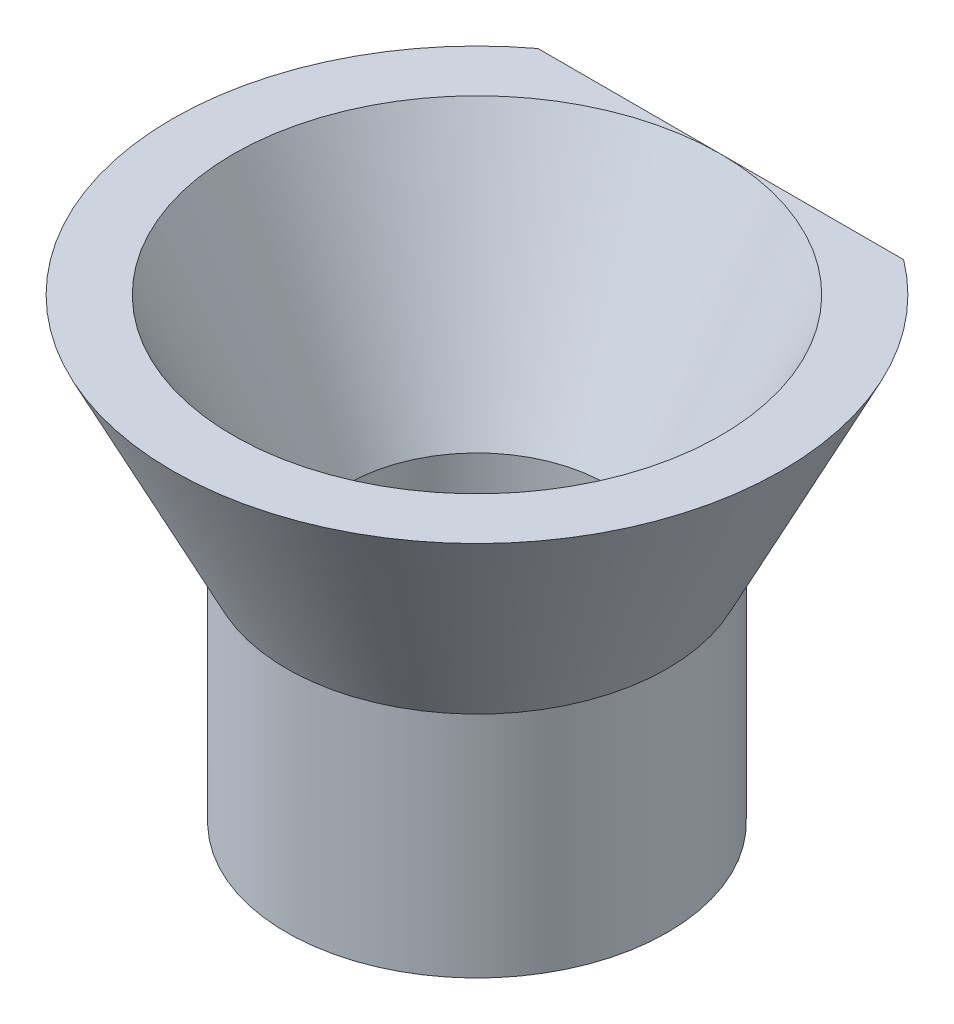
ISO-10303-21;
HEADER;
FILE_DESCRIPTION(('STEP AP214'),'2;1');
FILE_NAME('part.step','',(''),(''),'','','');
FILE_SCHEMA(('AUTOMOTIVE_DESIGN { 1 0 10303 214 1 1 1 1 }'));
ENDSEC;
DATA;
#1=APPLICATION_CONTEXT('core data for automotive mechanical design processes');
#2=APPLICATION_PROTOCOL_DEFINITION('international standard','automotive_design',2000,#1);
#3=PRODUCT_CONTEXT('',#1,'mechanical');
#4=PRODUCT('Part','Part','',(#3));
#5=PRODUCT_RELATED_PRODUCT_CATEGORY('part','',(#4));
#6=PRODUCT_DEFINITION_FORMATION('','',#4);
#7=PRODUCT_DEFINITION_CONTEXT('part definition',#1,'design');
#8=PRODUCT_DEFINITION('design','',#6,#7);
#9=PRODUCT_DEFINITION_SHAPE('','',#8);
#10=(LENGTH_UNIT() NAMED_UNIT(*) SI_UNIT(.MILLI.,.METRE.));
#11=(NAMED_UNIT(*) PLANE_ANGLE_UNIT() SI_UNIT($,.RADIAN.));
#12=(NAMED_UNIT(*) SI_UNIT($,.STERADIAN.) SOLID_ANGLE_UNIT());
#13=UNCERTAINTY_MEASURE_WITH_UNIT(LENGTH_MEASURE(1.E-05),#10,'distance_accuracy_value','');
#14=(GEOMETRIC_REPRESENTATION_CONTEXT(3) GLOBAL_UNCERTAINTY_ASSIGNED_CONTEXT((#13)) GLOBAL_UNIT_ASSIGNED_CONTEXT((#10,
#11,#12)) REPRESENTATION_CONTEXT('',''));
#15=CARTESIAN_POINT('',(0.,0.,0.));
#16=DIRECTION('',(0.,0.,1.));
#17=DIRECTION('',(1.,0.,0.));
#18=AXIS2_PLACEMENT_3D('',#15,#16,#17);
#19=CARTESIAN_POINT('',(0.,7.5,0.));
#20=DIRECTION('',(0.,1.,0.));
#21=DIRECTION('',(-1.,0.,0.));
#22=AXIS2_PLACEMENT_3D('',#19,#20,#21);
#23=CONICAL_SURFACE('',#22,10.,0.463647609000806);
#24=CARTESIAN_POINT('',(-12.483464519302,17.1537947928876,-8.));
#25=CARTESIAN_POINT('',(-12.2176903117161,16.7063471064967,-8.));
#26=CARTESIAN_POINT('',(-11.9501588751728,16.2599314212452,-8.));
#27=CARTESIAN_POINT('',(-11.4106666124813,15.3696780544552,-8.));
#28=CARTESIAN_POINT('',(-11.1387050071489,14.925840845459,-8.));
#29=CARTESIAN_POINT('',(-10.5874263949526,14.0380279909692,-8.));
#30=CARTESIAN_POINT('',(-10.3080689840772,13.594077367496,-8.));
#31=CARTESIAN_POINT('',(-9.74281308784089,12.7104203614526,-8.));
#32=CARTESIAN_POINT('',(-9.45691528753597,12.2707135411741,-8.));
#33=CARTESIAN_POINT('',(-8.84883235785064,11.354383788697,-8.));
#34=CARTESIAN_POINT('',(-8.52581443985341,10.8783097952812,-8.));
#35=CARTESIAN_POINT('',(-8.03152644212765,10.1708857963982,-8.));
#36=CARTESIAN_POINT('',(-7.86510364770432,9.93614734917569,-8.));
#37=CARTESIAN_POINT('',(-7.52849514478863,9.46938761143708,-8.));
#38=CARTESIAN_POINT('',(-7.35830954051645,9.2373662459364,-8.));
#39=CARTESIAN_POINT('',(-7.01414565228661,8.77739717629892,-8.));
#40=CARTESIAN_POINT('',(-6.8401825165595,8.5494381608394,-8.));
#41=CARTESIAN_POINT('',(-6.48713759743495,8.0975286635059,-8.));
#42=CARTESIAN_POINT('',(-6.30805613041065,7.87357793525815,-8.));
#43=CARTESIAN_POINT('',(-5.94391532388486,7.43080418466517,-8.));
#44=CARTESIAN_POINT('',(-5.75885968096171,7.21197813072789,-8.));
#45=CARTESIAN_POINT('',(-5.38148591572462,6.78070323424621,-8.));
#46=CARTESIAN_POINT('',(-5.18916913263823,6.56825322856726,-8.));
#47=CARTESIAN_POINT('',(-4.89787556173575,6.25982658488011,-8.));
#48=CARTESIAN_POINT('',(-4.80228291768864,6.16065045177227,-8.));
#49=CARTESIAN_POINT('',(-4.60885073612191,5.9645128013991,-8.));
#50=CARTESIAN_POINT('',(-4.51101114716198,5.86755133493669,-8.));
#51=CARTESIAN_POINT('',(-4.21367336017731,5.58035643879239,-8.));
#52=CARTESIAN_POINT('',(-4.0104535757572,5.39391680882617,-8.));
#53=CARTESIAN_POINT('',(-3.59418032767355,5.03660414230026,-8.));
#54=CARTESIAN_POINT('',(-3.3812447140748,4.86559477381106,-8.));
#55=CARTESIAN_POINT('',(-2.94154972325818,4.54241182107781,-8.));
#56=CARTESIAN_POINT('',(-2.7148057375995,4.39021781769847,-8.));
#57=CARTESIAN_POINT('',(-2.36571692774588,4.18348931214176,-8.));
#58=CARTESIAN_POINT('',(-2.24934355969825,4.11884271987032,-8.));
#59=CARTESIAN_POINT('',(-2.01272299557833,3.99702727146163,-8.));
#60=CARTESIAN_POINT('',(-1.89247607342263,3.93985788801741,-8.));
#61=CARTESIAN_POINT('',(-1.64826888681976,3.83433164269941,-8.));
#62=CARTESIAN_POINT('',(-1.52431186442723,3.78596733407817,-8.));
#63=CARTESIAN_POINT('',(-1.27291252397117,3.69938101083731,-8.));
#64=CARTESIAN_POINT('',(-1.1454712285237,3.66115605488138,-8.));
#65=CARTESIAN_POINT('',(-0.885883764474307,3.59571299911659,-8.));
#66=CARTESIAN_POINT('',(-0.753696899728019,3.56865446917873,-8.));
#67=CARTESIAN_POINT('',(-0.487310782236509,3.52745744891243,-8.));
#68=CARTESIAN_POINT('',(-0.353111680500533,3.51331799394967,-8.));
#69=CARTESIAN_POINT('',(-0.0839698811136931,3.49861979346302,-8.));
#70=CARTESIAN_POINT('',(0.0509727801258223,3.49806038874664,-8.));
#71=CARTESIAN_POINT('',(0.320218028186442,3.51054986637249,-8.));
#72=CARTESIAN_POINT('',(0.45452064020834,3.52359820841209,-8.));
#73=CARTESIAN_POINT('',(0.702065443281383,3.55987622339056,-8.));
#74=CARTESIAN_POINT('',(0.815566443141345,3.58137795941833,-8.));
#75=CARTESIAN_POINT('',(1.04054660506672,3.63322466963792,-8.));
#76=CARTESIAN_POINT('',(1.15202503793673,3.66357276845548,-8.));
#77=CARTESIAN_POINT('',(1.48258813463464,3.76662478948319,-8.));
#78=CARTESIAN_POINT('',(1.69797589838726,3.85136427944728,-8.));
#79=CARTESIAN_POINT('',(2.09779945819872,4.03678535252537,-8.));
#80=CARTESIAN_POINT('',(2.28326894085057,4.1353170818644,-8.));
#81=CARTESIAN_POINT('',(2.64497555504296,4.34826658550399,-8.));
#82=CARTESIAN_POINT('',(2.8212046881153,4.46269781968723,-8.));
#83=CARTESIAN_POINT('',(3.16584266642003,4.70422977822699,-8.));
#84=CARTESIAN_POINT('',(3.33421242981379,4.83138559599771,-8.));
#85=CARTESIAN_POINT('',(3.66326334100313,5.09508958557527,-8.));
#86=CARTESIAN_POINT('',(3.82394744691278,5.23163409365674,-8.));
#87=CARTESIAN_POINT('',(4.11754500865638,5.49325586582671,-8.));
#88=CARTESIAN_POINT('',(4.25128862139127,5.61740832722549,-8.));
#89=CARTESIAN_POINT('',(4.51441446369866,5.87026359513582,-8.));
#90=CARTESIAN_POINT('',(4.64379621931544,5.99896689304435,-8.));
#91=CARTESIAN_POINT('',(5.02632542321177,6.39082158669076,-8.));
#92=CARTESIAN_POINT('',(5.27371879372437,6.65959206458879,-8.));
#93=CARTESIAN_POINT('',(5.75704019091339,7.2082683944095,-8.));
#94=CARTESIAN_POINT('',(5.99293927481209,7.48819942386408,-8.));
#95=CARTESIAN_POINT('',(6.45508154291409,8.05576300022805,-8.));
#96=CARTESIAN_POINT('',(6.68132734629828,8.34339342318177,-8.));
#97=CARTESIAN_POINT('',(7.12831810484655,8.92746203108451,-8.));
#98=CARTESIAN_POINT('',(7.34898503910514,9.22395964826599,-8.));
#99=CARTESIAN_POINT('',(7.78388862375593,9.82164695571978,-8.));
#100=CARTESIAN_POINT('',(7.99812489025303,10.1228369244901,-8.));
#101=CARTESIAN_POINT('',(8.42093451624405,10.7284667299519,-8.));
#102=CARTESIAN_POINT('',(8.62951609145557,11.0329008451034,-8.));
#103=CARTESIAN_POINT('',(9.042210255015,11.6447631927312,-8.));
#104=CARTESIAN_POINT('',(9.24632298859126,11.9521913274373,-8.));
#105=CARTESIAN_POINT('',(9.65419435106521,12.5747528847138,-8.));
#106=CARTESIAN_POINT('',(9.85788834888876,12.8899285919333,-8.));
#107=CARTESIAN_POINT('',(10.2619351315843,13.5224161079553,-8.));
#108=CARTESIAN_POINT('',(10.4622878788336,13.8397279407545,-8.));
#109=CARTESIAN_POINT('',(11.059070191969,14.794380045024,-8.));
#110=CARTESIAN_POINT('',(11.4512039792901,15.434406405049,-8.));
#111=CARTESIAN_POINT('',(12.2268695889755,16.7198119160323,-8.));
#112=CARTESIAN_POINT('',(12.6103995849563,17.3651921644043,-8.));
#113=CARTESIAN_POINT('',(13.3706823528799,18.6599376968411,-8.));
#114=CARTESIAN_POINT('',(13.7474350401016,19.3093030305863,-8.));
#115=CARTESIAN_POINT('',(14.4961188219649,20.6121367190857,-8.));
#116=CARTESIAN_POINT('',(14.868041571539,21.2656098616909,-8.));
#117=CARTESIAN_POINT('',(15.6074999825743,22.5750360683232,-8.));
#118=CARTESIAN_POINT('',(15.9750356188315,23.230989146569,-8.));
#119=CARTESIAN_POINT('',(16.7064496749248,24.5448167508334,-8.));
#120=CARTESIAN_POINT('',(17.0703285682515,25.2026910134725,-8.));
#121=CARTESIAN_POINT('',(17.7950766936827,26.5200952779197,-8.));
#122=CARTESIAN_POINT('',(18.1559459213497,27.1796252821673,-8.));
#123=CARTESIAN_POINT('',(19.1779117828042,29.0558909829487,-8.));
#124=CARTESIAN_POINT('',(19.8359898841221,30.274270749616,-8.));
#125=CARTESIAN_POINT('',(21.1457856486666,32.7144995736717,-8.));
#126=CARTESIAN_POINT('',(21.7975030622119,33.9363487648373,-8.));
#127=CARTESIAN_POINT('',(23.0943557433501,36.3795258135076,-8.));
#128=CARTESIAN_POINT('',(23.739503590879,37.6008469968123,-8.));
#129=CARTESIAN_POINT('',(24.7043183109229,39.4343179513706,-8.));
#130=CARTESIAN_POINT('',(25.0254307445334,40.045707881065,-8.));
#131=CARTESIAN_POINT('',(25.6667891904272,41.2689413810986,-8.));
#132=CARTESIAN_POINT('',(25.98703520345,41.8807849510501,-8.));
#133=CARTESIAN_POINT('',(26.3068968591933,42.4928294365815,-8.));
#134=B_SPLINE_CURVE_WITH_KNOTS('',3,(#24,#25,#26,#27,#28,#29,#30,#31,#32,#33,#34,#35,#36,#37,
#38,#39,#40,#41,#42,#43,#44,#45,#46,#47,#48,#49,#50,#51,#52,#53,#54,#55,#56,#57,#58,#59,#60,#61,
#62,#63,#64,#65,#66,#67,#68,#69,#70,#71,#72,#73,#74,#75,#76,#77,#78,#79,#80,#81,#82,#83,#84,#85,
#86,#87,#88,#89,#90,#91,#92,#93,#94,#95,#96,#97,#98,#99,#100,#101,#102,#103,#104,#105,#106,#107,
#108,#109,#110,#111,#112,#113,#114,#115,#116,#117,#118,#119,#120,#121,#122,#123,#124,#125,#126,
#127,#128,#129,#130,#131,#132,#133),.UNSPECIFIED.,.F.,.F.,(4,2,2,2,2,2,2,2,2,2,2,2,2,2,2,2,2,2,
2,2,2,2,2,2,2,2,2,2,2,2,2,2,2,2,2,2,2,2,2,2,2,2,2,2,2,2,2,2,2,2,2,2,2,2,4),(0.,1.5612949852985,
3.12286760343757,4.69641124818769,6.26979082411401,7.99554726640557,8.85876089760058,
9.72195064986757,10.5821558211341,11.4423079360965,12.30193765725,13.1614095974944,
13.5746138450108,13.9878275616449,14.8146827483492,15.6333175375342,16.451055966143,
16.8502131202635,17.2493421098671,17.648131958487,18.0468059948763,18.4509948103106,
18.8551534435314,19.2592924583513,19.6634154272329,20.0095983748899,20.3559037463722,
21.047987423375,21.6771489669809,22.3068464160031,22.9393990392057,23.5717062087011,
24.1190426290518,24.6664383320794,25.7617888200302,26.8597682328395,27.9574478164105,
29.0661466221373,30.1749114833622,31.2819681987751,32.3889888835114,33.5147715751334,
34.6405669346172,36.8922668507071,39.1444403115686,41.3966419066966,43.6523217945701,
45.9080146351075,48.163411534726,50.4188117591244,54.573014806228,58.727380271121,
62.8711096162574,64.9428710526221,67.0146307203731),.UNSPECIFIED.);
#135=CARTESIAN_POINT('',(6.,7.5,-8.));
#136=VERTEX_POINT('',#135);
#137=CARTESIAN_POINT('',(-6.,7.5,-8.));
#138=VERTEX_POINT('',#137);
#139=EDGE_CURVE('E51',#136,#138,#134,.F.);
#140=ORIENTED_EDGE('',*,*,#139,.F.);
#141=CARTESIAN_POINT('',(0.,7.5,0.));
#142=DIRECTION('',(0.,1.,0.));
#143=DIRECTION('',(-1.,0.,0.));
#144=AXIS2_PLACEMENT_3D('',#141,#142,#143);
#145=CIRCLE('',#144,10.);
#146=EDGE_CURVE('E61',#138,#136,#145,.T.);
#147=ORIENTED_EDGE('',*,*,#146,.F.);
#148=EDGE_LOOP('',(#140,#147));
#149=FACE_BOUND('',#148,.T.);
#150=CARTESIAN_POINT('',(0.,0.,0.));
#151=DIRECTION('',(0.,-1.,0.));
#152=DIRECTION('',(1.,0.,0.));
#153=AXIS2_PLACEMENT_3D('',#150,#151,#152);
#154=CIRCLE('',#153,6.25);
#155=CARTESIAN_POINT('',(6.25,0.,0.));
#156=VERTEX_POINT('',#155);
#157=EDGE_CURVE('E70',#156,#156,#154,.T.);
#158=ORIENTED_EDGE('',*,*,#157,.F.);
#159=EDGE_LOOP('',(#158));
#160=FACE_BOUND('',#159,.T.);
#161=ADVANCED_FACE('F33',(#149,#160),#23,.T.);
#162=CARTESIAN_POINT('',(0.,0.,0.));
#163=DIRECTION('',(0.,1.,0.));
#164=DIRECTION('',(-1.,0.,0.));
#165=AXIS2_PLACEMENT_3D('',#162,#163,#164);
#166=CONICAL_SURFACE('',#165,4.25,0.463647609000806);
#167=CARTESIAN_POINT('',(0.,7.5,0.));
#168=DIRECTION('',(0.,1.,0.));
#169=DIRECTION('',(-1.,0.,0.));
#170=AXIS2_PLACEMENT_3D('',#167,#168,#169);
#171=CIRCLE('',#170,8.);
#172=CARTESIAN_POINT('',(0.,7.5,-8.));
#173=VERTEX_POINT('',#172);
#174=EDGE_CURVE('E63',#173,#173,#171,.T.);
#175=ORIENTED_EDGE('',*,*,#174,.T.);
#176=EDGE_LOOP('',(#175));
#177=FACE_BOUND('',#176,.T.);
#178=CARTESIAN_POINT('',(0.,0.,0.));
#179=DIRECTION('',(0.,1.,0.));
#180=DIRECTION('',(-1.,0.,0.));
#181=AXIS2_PLACEMENT_3D('',#178,#179,#180);
#182=CIRCLE('',#181,4.25);
#183=CARTESIAN_POINT('',(-4.25,0.,0.));
#184=VERTEX_POINT('',#183);
#185=EDGE_CURVE('E67',#184,#184,#182,.T.);
#186=ORIENTED_EDGE('',*,*,#185,.F.);
#187=EDGE_LOOP('',(#186));
#188=FACE_BOUND('',#187,.T.);
#189=ADVANCED_FACE('F78',(#177,#188),#166,.F.);
#190=CARTESIAN_POINT('',(-8.,7.5,0.));
#191=DIRECTION('',(0.,1.,0.));
#192=DIRECTION('',(-1.,0.,0.));
#193=AXIS2_PLACEMENT_3D('',#190,#191,#192);
#194=PLANE('',#193);
#195=DIRECTION('',(1.,0.,0.));
#196=VECTOR('',#195,1.);
#197=CARTESIAN_POINT('',(-8.,7.5,-8.));
#198=LINE('',#197,#196);
#199=EDGE_CURVE('E11',#138,#173,#198,.T.);
#200=ORIENTED_EDGE('',*,*,#199,.F.);
#201=ORIENTED_EDGE('',*,*,#146,.T.);
#202=EDGE_CURVE('E37',#173,#136,#198,.T.);
#203=ORIENTED_EDGE('',*,*,#202,.F.);
#204=ORIENTED_EDGE('',*,*,#174,.F.);
#205=EDGE_LOOP('',(#200,#201,#203,#204));
#206=FACE_BOUND('',#205,.T.);
#207=ADVANCED_FACE('F60',(#206),#194,.T.);
#208=CARTESIAN_POINT('',(0.,-7.5,0.));
#209=DIRECTION('',(0.,-1.,0.));
#210=DIRECTION('',(1.,0.,0.));
#211=AXIS2_PLACEMENT_3D('',#208,#209,#210);
#212=PLANE('',#211);
#213=CARTESIAN_POINT('',(0.,-7.5,0.));
#214=DIRECTION('',(0.,-1.,0.));
#215=DIRECTION('',(1.,0.,0.));
#216=AXIS2_PLACEMENT_3D('',#213,#214,#215);
#217=CIRCLE('',#216,6.25);
#218=CARTESIAN_POINT('',(6.25,-7.5,0.));
#219=VERTEX_POINT('',#218);
#220=EDGE_CURVE('E65',#219,#219,#217,.T.);
#221=ORIENTED_EDGE('',*,*,#220,.T.);
#222=EDGE_LOOP('',(#221));
#223=FACE_BOUND('',#222,.T.);
#224=CARTESIAN_POINT('',(0.,-7.5,0.));
#225=DIRECTION('',(0.,-1.,0.));
#226=DIRECTION('',(1.,0.,0.));
#227=AXIS2_PLACEMENT_3D('',#224,#225,#226);
#228=CIRCLE('',#227,4.25);
#229=CARTESIAN_POINT('',(4.25,-7.5,0.));
#230=VERTEX_POINT('',#229);
#231=EDGE_CURVE('E56',#230,#230,#228,.T.);
#232=ORIENTED_EDGE('',*,*,#231,.F.);
#233=EDGE_LOOP('',(#232));
#234=FACE_BOUND('',#233,.T.);
#235=ADVANCED_FACE('F85',(#223,#234),#212,.T.);
#236=CARTESIAN_POINT('',(0.,-7.5,0.));
#237=DIRECTION('',(0.,1.,0.));
#238=DIRECTION('',(-1.,0.,0.));
#239=AXIS2_PLACEMENT_3D('',#236,#237,#238);
#240=CYLINDRICAL_SURFACE('',#239,6.25);
#241=ORIENTED_EDGE('',*,*,#220,.F.);
#242=EDGE_LOOP('',(#241));
#243=FACE_BOUND('',#242,.T.);
#244=ORIENTED_EDGE('',*,*,#157,.T.);
#245=EDGE_LOOP('',(#244));
#246=FACE_BOUND('',#245,.T.);
#247=ADVANCED_FACE('F88',(#243,#246),#240,.T.);
#248=CARTESIAN_POINT('',(0.,-7.5,0.));
#249=DIRECTION('',(0.,1.,0.));
#250=DIRECTION('',(-1.,0.,0.));
#251=AXIS2_PLACEMENT_3D('',#248,#249,#250);
#252=CYLINDRICAL_SURFACE('',#251,4.25);
#253=ORIENTED_EDGE('',*,*,#231,.T.);
#254=EDGE_LOOP('',(#253));
#255=FACE_BOUND('',#254,.T.);
#256=ORIENTED_EDGE('',*,*,#185,.T.);
#257=EDGE_LOOP('',(#256));
#258=FACE_BOUND('',#257,.T.);
#259=ADVANCED_FACE('F76',(#255,#258),#252,.F.);
#260=CARTESIAN_POINT('',(-7.81654192391267,-2.5,-8.));
#261=DIRECTION('',(0.,0.,1.));
#262=DIRECTION('',(1.,0.,0.));
#263=AXIS2_PLACEMENT_3D('',#260,#261,#262);
#264=PLANE('',#263);
#265=ORIENTED_EDGE('',*,*,#139,.T.);
#266=ORIENTED_EDGE('',*,*,#199,.T.);
#267=ORIENTED_EDGE('',*,*,#202,.T.);
#268=EDGE_LOOP('',(#265,#266,#267));
#269=FACE_BOUND('',#268,.T.);
#270=ADVANCED_FACE('F52',(#269),#264,.F.);
#271=CLOSED_SHELL('',(#161,#189,#207,#235,#247,#259,#270));
#272=MANIFOLD_SOLID_BREP('B2',#271);
#273=ADVANCED_BREP_SHAPE_REPRESENTATION('',(#18,#272),#14);
#274=SHAPE_DEFINITION_REPRESENTATION(#9,#273);
ENDSEC;
END-ISO-10303-21;
